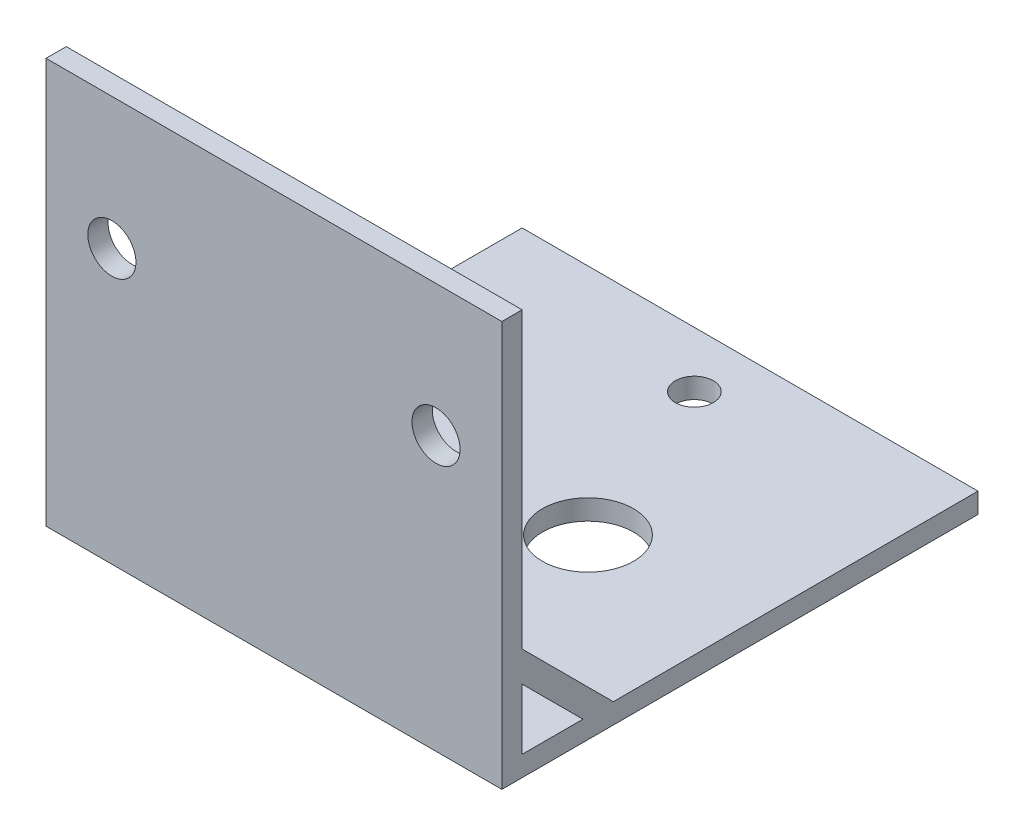
ISO-10303-21;
HEADER;
FILE_DESCRIPTION(('STEP AP214'),'2;1');
FILE_NAME('part.step','',(''),(''),'','','');
FILE_SCHEMA(('AUTOMOTIVE_DESIGN { 1 0 10303 214 1 1 1 1 }'));
ENDSEC;
DATA;
#1=APPLICATION_CONTEXT('core data for automotive mechanical design processes');
#2=APPLICATION_PROTOCOL_DEFINITION('international standard','automotive_design',2000,#1);
#3=PRODUCT_CONTEXT('',#1,'mechanical');
#4=PRODUCT('Part','Part','',(#3));
#5=PRODUCT_RELATED_PRODUCT_CATEGORY('part','',(#4));
#6=PRODUCT_DEFINITION_FORMATION('','',#4);
#7=PRODUCT_DEFINITION_CONTEXT('part definition',#1,'design');
#8=PRODUCT_DEFINITION('design','',#6,#7);
#9=PRODUCT_DEFINITION_SHAPE('','',#8);
#10=(LENGTH_UNIT() NAMED_UNIT(*) SI_UNIT(.MILLI.,.METRE.));
#11=(NAMED_UNIT(*) PLANE_ANGLE_UNIT() SI_UNIT($,.RADIAN.));
#12=(NAMED_UNIT(*) SI_UNIT($,.STERADIAN.) SOLID_ANGLE_UNIT());
#13=UNCERTAINTY_MEASURE_WITH_UNIT(LENGTH_MEASURE(1.E-05),#10,'distance_accuracy_value','');
#14=(GEOMETRIC_REPRESENTATION_CONTEXT(3) GLOBAL_UNCERTAINTY_ASSIGNED_CONTEXT((#13)) GLOBAL_UNIT_ASSIGNED_CONTEXT((#10,
#11,#12)) REPRESENTATION_CONTEXT('',''));
#15=CARTESIAN_POINT('',(0.,0.,0.));
#16=DIRECTION('',(0.,0.,1.));
#17=DIRECTION('',(1.,0.,0.));
#18=AXIS2_PLACEMENT_3D('',#15,#16,#17);
#19=CARTESIAN_POINT('',(0.,2.,0.));
#20=DIRECTION('',(0.,1.,0.));
#21=DIRECTION('',(0.,0.,1.));
#22=AXIS2_PLACEMENT_3D('',#19,#20,#21);
#23=PLANE('',#22);
#24=CARTESIAN_POINT('',(5.75628954535205,2.,136.050969125864));
#25=DIRECTION('',(0.,1.,0.));
#26=DIRECTION('',(0.,0.,1.));
#27=AXIS2_PLACEMENT_3D('',#24,#25,#26);
#28=CIRCLE('',#27,1.875);
#29=CARTESIAN_POINT('',(5.75628954535205,2.,137.925969125864));
#30=VERTEX_POINT('',#29);
#31=EDGE_CURVE('E250',#30,#30,#28,.T.);
#32=ORIENTED_EDGE('',*,*,#31,.F.);
#33=EDGE_LOOP('',(#32));
#34=FACE_BOUND('',#33,.T.);
#35=CARTESIAN_POINT('',(5.75628954535205,2.,101.050969125864));
#36=DIRECTION('',(0.,1.,0.));
#37=DIRECTION('',(0.,0.,1.));
#38=AXIS2_PLACEMENT_3D('',#35,#36,#37);
#39=CIRCLE('',#38,1.875);
#40=CARTESIAN_POINT('',(5.75628954535205,2.,102.925969125864));
#41=VERTEX_POINT('',#40);
#42=EDGE_CURVE('E254',#41,#41,#39,.T.);
#43=ORIENTED_EDGE('',*,*,#42,.F.);
#44=EDGE_LOOP('',(#43));
#45=FACE_BOUND('',#44,.T.);
#46=CARTESIAN_POINT('',(12.756289545352,2.,118.550969125864));
#47=DIRECTION('',(0.,1.,0.));
#48=DIRECTION('',(0.,0.,1.));
#49=AXIS2_PLACEMENT_3D('',#46,#47,#48);
#50=CIRCLE('',#49,4.50000000000002);
#51=CARTESIAN_POINT('',(12.756289545352,2.,123.050969125864));
#52=VERTEX_POINT('',#51);
#53=EDGE_CURVE('E275',#52,#52,#50,.T.);
#54=ORIENTED_EDGE('',*,*,#53,.F.);
#55=EDGE_LOOP('',(#54));
#56=FACE_BOUND('',#55,.T.);
#57=DIRECTION('',(0.,0.,1.));
#58=VECTOR('',#57,1.);
#59=CARTESIAN_POINT('',(26.2562895453521,2.,134.550969125864));
#60=LINE('',#59,#58);
#61=CARTESIAN_POINT('',(26.2562895453521,2.,131.550969125864));
#62=VERTEX_POINT('',#61);
#63=CARTESIAN_POINT('',(26.2562895453521,2.,134.550969125864));
#64=VERTEX_POINT('',#63);
#65=EDGE_CURVE('E143',#62,#64,#60,.T.);
#66=ORIENTED_EDGE('',*,*,#65,.F.);
#67=DIRECTION('',(1.,0.,0.));
#68=VECTOR('',#67,1.);
#69=CARTESIAN_POINT('',(26.2562895453521,2.,131.550969125864));
#70=LINE('',#69,#68);
#71=CARTESIAN_POINT('',(28.2562895453521,2.,131.550969125864));
#72=VERTEX_POINT('',#71);
#73=EDGE_CURVE('E166',#62,#72,#70,.T.);
#74=ORIENTED_EDGE('',*,*,#73,.T.);
#75=DIRECTION('',(0.,0.,1.));
#76=VECTOR('',#75,1.);
#77=CARTESIAN_POINT('',(28.256289545352,2.,0.));
#78=LINE('',#77,#76);
#79=CARTESIAN_POINT('',(28.2562895453521,2.,95.550969125864));
#80=VERTEX_POINT('',#79);
#81=EDGE_CURVE('E271',#80,#72,#78,.T.);
#82=ORIENTED_EDGE('',*,*,#81,.F.);
#83=DIRECTION('',(-1.,0.,0.));
#84=VECTOR('',#83,1.);
#85=CARTESIAN_POINT('',(0.,2.,95.550969125864));
#86=LINE('',#85,#84);
#87=CARTESIAN_POINT('',(-16.7437104546479,2.,95.550969125864));
#88=VERTEX_POINT('',#87);
#89=EDGE_CURVE('E259',#80,#88,#86,.T.);
#90=ORIENTED_EDGE('',*,*,#89,.T.);
#91=DIRECTION('',(0.,0.,1.));
#92=VECTOR('',#91,1.);
#93=CARTESIAN_POINT('',(-16.7437104546479,2.,0.));
#94=LINE('',#93,#92);
#95=CARTESIAN_POINT('',(-16.743710454648,2.,131.550969125864));
#96=VERTEX_POINT('',#95);
#97=EDGE_CURVE('E264',#88,#96,#94,.T.);
#98=ORIENTED_EDGE('',*,*,#97,.T.);
#99=DIRECTION('',(-1.,0.,0.));
#100=VECTOR('',#99,1.);
#101=CARTESIAN_POINT('',(-14.743710454648,2.,131.550969125864));
#102=LINE('',#101,#100);
#103=CARTESIAN_POINT('',(-14.743710454648,2.,131.550969125864));
#104=VERTEX_POINT('',#103);
#105=EDGE_CURVE('E207',#104,#96,#102,.T.);
#106=ORIENTED_EDGE('',*,*,#105,.F.);
#107=DIRECTION('',(0.,0.,1.));
#108=VECTOR('',#107,1.);
#109=CARTESIAN_POINT('',(-14.743710454648,2.,134.550969125864));
#110=LINE('',#109,#108);
#111=CARTESIAN_POINT('',(-14.743710454648,2.,134.550969125864));
#112=VERTEX_POINT('',#111);
#113=EDGE_CURVE('E184',#104,#112,#110,.T.);
#114=ORIENTED_EDGE('',*,*,#113,.T.);
#115=DIRECTION('',(-1.,0.,0.));
#116=VECTOR('',#115,1.);
#117=CARTESIAN_POINT('',(-14.743710454648,2.,134.550969125864));
#118=LINE('',#117,#116);
#119=CARTESIAN_POINT('',(-16.743710454648,2.,134.550969125864));
#120=VERTEX_POINT('',#119);
#121=EDGE_CURVE('E203',#112,#120,#118,.T.);
#122=ORIENTED_EDGE('',*,*,#121,.T.);
#123=CARTESIAN_POINT('',(-16.7437104546479,2.,140.550969125864));
#124=VERTEX_POINT('',#123);
#125=EDGE_CURVE('E263',#120,#124,#94,.T.);
#126=ORIENTED_EDGE('',*,*,#125,.T.);
#127=DIRECTION('',(-1.,0.,0.));
#128=VECTOR('',#127,1.);
#129=CARTESIAN_POINT('',(0.,2.,140.550969125864));
#130=LINE('',#129,#128);
#131=CARTESIAN_POINT('',(28.2562895453521,2.,140.550969125864));
#132=VERTEX_POINT('',#131);
#133=EDGE_CURVE('E267',#132,#124,#130,.T.);
#134=ORIENTED_EDGE('',*,*,#133,.F.);
#135=CARTESIAN_POINT('',(28.2562895453521,2.,134.550969125864));
#136=VERTEX_POINT('',#135);
#137=EDGE_CURVE('E164',#136,#132,#78,.T.);
#138=ORIENTED_EDGE('',*,*,#137,.F.);
#139=DIRECTION('',(1.,0.,0.));
#140=VECTOR('',#139,1.);
#141=CARTESIAN_POINT('',(26.2562895453521,2.,134.550969125864));
#142=LINE('',#141,#140);
#143=EDGE_CURVE('E158',#64,#136,#142,.T.);
#144=ORIENTED_EDGE('',*,*,#143,.F.);
#145=EDGE_LOOP('',(#66,#74,#82,#90,#98,#106,#114,#122,#126,#134,#138,#144));
#146=FACE_BOUND('',#145,.T.);
#147=ADVANCED_FACE('F41',(#34,#45,#56,#146),#23,.T.);
#148=CARTESIAN_POINT('',(0.,40.,140.550969125864));
#149=DIRECTION('',(0.,0.,1.));
#150=DIRECTION('',(1.,0.,0.));
#151=AXIS2_PLACEMENT_3D('',#148,#149,#150);
#152=PLANE('',#151);
#153=CARTESIAN_POINT('',(21.756289545352,27.,140.550969125864));
#154=DIRECTION('',(0.,0.,1.));
#155=DIRECTION('',(1.,0.,0.));
#156=AXIS2_PLACEMENT_3D('',#153,#154,#155);
#157=CIRCLE('',#156,2.375);
#158=CARTESIAN_POINT('',(24.131289545352,27.,140.550969125864));
#159=VERTEX_POINT('',#158);
#160=EDGE_CURVE('E331',#159,#159,#157,.T.);
#161=ORIENTED_EDGE('',*,*,#160,.T.);
#162=EDGE_LOOP('',(#161));
#163=FACE_BOUND('',#162,.T.);
#164=CARTESIAN_POINT('',(-10.243710454648,27.,140.550969125864));
#165=DIRECTION('',(0.,0.,1.));
#166=DIRECTION('',(1.,0.,0.));
#167=AXIS2_PLACEMENT_3D('',#164,#165,#166);
#168=CIRCLE('',#167,2.375);
#169=CARTESIAN_POINT('',(-7.86871045464796,27.,140.550969125864));
#170=VERTEX_POINT('',#169);
#171=EDGE_CURVE('E339',#170,#170,#168,.T.);
#172=ORIENTED_EDGE('',*,*,#171,.T.);
#173=EDGE_LOOP('',(#172));
#174=FACE_BOUND('',#173,.T.);
#175=DIRECTION('',(1.,0.,0.));
#176=VECTOR('',#175,1.);
#177=CARTESIAN_POINT('',(26.2562895453521,11.,140.550969125864));
#178=LINE('',#177,#176);
#179=CARTESIAN_POINT('',(26.2562895453521,11.,140.550969125864));
#180=VERTEX_POINT('',#179);
#181=CARTESIAN_POINT('',(28.2562895453521,11.,140.550969125864));
#182=VERTEX_POINT('',#181);
#183=EDGE_CURVE('E170',#180,#182,#178,.T.);
#184=ORIENTED_EDGE('',*,*,#183,.F.);
#185=DIRECTION('',(0.,1.,0.));
#186=VECTOR('',#185,1.);
#187=CARTESIAN_POINT('',(26.2562895453521,11.,140.550969125864));
#188=LINE('',#187,#186);
#189=CARTESIAN_POINT('',(26.2562895453521,8.,140.550969125864));
#190=VERTEX_POINT('',#189);
#191=EDGE_CURVE('E65',#190,#180,#188,.T.);
#192=ORIENTED_EDGE('',*,*,#191,.F.);
#193=DIRECTION('',(1.,0.,0.));
#194=VECTOR('',#193,1.);
#195=CARTESIAN_POINT('',(26.2562895453521,8.,140.550969125864));
#196=LINE('',#195,#194);
#197=CARTESIAN_POINT('',(28.2562895453521,8.,140.550969125864));
#198=VERTEX_POINT('',#197);
#199=EDGE_CURVE('E160',#190,#198,#196,.T.);
#200=ORIENTED_EDGE('',*,*,#199,.T.);
#201=DIRECTION('',(0.,-1.,0.));
#202=VECTOR('',#201,1.);
#203=CARTESIAN_POINT('',(28.2562895453521,40.,140.550969125864));
#204=LINE('',#203,#202);
#205=EDGE_CURVE('E229',#198,#132,#204,.T.);
#206=ORIENTED_EDGE('',*,*,#205,.T.);
#207=ORIENTED_EDGE('',*,*,#133,.T.);
#208=DIRECTION('',(0.,-1.,0.));
#209=VECTOR('',#208,1.);
#210=CARTESIAN_POINT('',(-16.7437104546479,40.,140.550969125864));
#211=LINE('',#210,#209);
#212=CARTESIAN_POINT('',(-16.7437104546479,8.,140.550969125864));
#213=VERTEX_POINT('',#212);
#214=EDGE_CURVE('E244',#213,#124,#211,.T.);
#215=ORIENTED_EDGE('',*,*,#214,.F.);
#216=DIRECTION('',(-1.,0.,0.));
#217=VECTOR('',#216,1.);
#218=CARTESIAN_POINT('',(-14.743710454648,8.,140.550969125864));
#219=LINE('',#218,#217);
#220=CARTESIAN_POINT('',(-14.743710454648,8.,140.550969125864));
#221=VERTEX_POINT('',#220);
#222=EDGE_CURVE('E198',#221,#213,#219,.T.);
#223=ORIENTED_EDGE('',*,*,#222,.F.);
#224=DIRECTION('',(0.,1.,0.));
#225=VECTOR('',#224,1.);
#226=CARTESIAN_POINT('',(-14.743710454648,11.,140.550969125864));
#227=LINE('',#226,#225);
#228=CARTESIAN_POINT('',(-14.743710454648,11.,140.550969125864));
#229=VERTEX_POINT('',#228);
#230=EDGE_CURVE('E175',#221,#229,#227,.T.);
#231=ORIENTED_EDGE('',*,*,#230,.T.);
#232=DIRECTION('',(-1.,0.,0.));
#233=VECTOR('',#232,1.);
#234=CARTESIAN_POINT('',(-14.743710454648,11.,140.550969125864));
#235=LINE('',#234,#233);
#236=CARTESIAN_POINT('',(-16.743710454648,11.,140.550969125864));
#237=VERTEX_POINT('',#236);
#238=EDGE_CURVE('E191',#229,#237,#235,.T.);
#239=ORIENTED_EDGE('',*,*,#238,.T.);
#240=CARTESIAN_POINT('',(-16.7437104546479,40.,140.550969125864));
#241=VERTEX_POINT('',#240);
#242=EDGE_CURVE('E245',#241,#237,#211,.T.);
#243=ORIENTED_EDGE('',*,*,#242,.F.);
#244=DIRECTION('',(-1.,0.,0.));
#245=VECTOR('',#244,1.);
#246=CARTESIAN_POINT('',(0.,40.,140.550969125864));
#247=LINE('',#246,#245);
#248=CARTESIAN_POINT('',(28.2562895453521,40.,140.550969125864));
#249=VERTEX_POINT('',#248);
#250=EDGE_CURVE('E214',#249,#241,#247,.T.);
#251=ORIENTED_EDGE('',*,*,#250,.F.);
#252=EDGE_CURVE('E233',#249,#182,#204,.T.);
#253=ORIENTED_EDGE('',*,*,#252,.T.);
#254=EDGE_LOOP('',(#184,#192,#200,#206,#207,#215,#223,#231,#239,#243,#251,#253));
#255=FACE_BOUND('',#254,.T.);
#256=ADVANCED_FACE('F367',(#163,#174,#255),#152,.F.);
#257=CARTESIAN_POINT('',(0.,2.,95.550969125864));
#258=DIRECTION('',(0.,0.,1.));
#259=DIRECTION('',(1.,0.,0.));
#260=AXIS2_PLACEMENT_3D('',#257,#258,#259);
#261=PLANE('',#260);
#262=DIRECTION('',(-1.,0.,0.));
#263=VECTOR('',#262,1.);
#264=CARTESIAN_POINT('',(0.,0.,95.550969125864));
#265=LINE('',#264,#263);
#266=CARTESIAN_POINT('',(28.2562895453521,0.,95.550969125864));
#267=VERTEX_POINT('',#266);
#268=CARTESIAN_POINT('',(-16.7437104546479,0.,95.550969125864));
#269=VERTEX_POINT('',#268);
#270=EDGE_CURVE('E286',#267,#269,#265,.T.);
#271=ORIENTED_EDGE('',*,*,#270,.T.);
#272=DIRECTION('',(0.,-1.,0.));
#273=VECTOR('',#272,1.);
#274=CARTESIAN_POINT('',(-16.7437104546479,2.,95.550969125864));
#275=LINE('',#274,#273);
#276=EDGE_CURVE('E11',#88,#269,#275,.T.);
#277=ORIENTED_EDGE('',*,*,#276,.F.);
#278=ORIENTED_EDGE('',*,*,#89,.F.);
#279=DIRECTION('',(0.,-1.,0.));
#280=VECTOR('',#279,1.);
#281=CARTESIAN_POINT('',(28.2562895453521,2.,95.550969125864));
#282=LINE('',#281,#280);
#283=EDGE_CURVE('E50',#80,#267,#282,.T.);
#284=ORIENTED_EDGE('',*,*,#283,.T.);
#285=EDGE_LOOP('',(#271,#277,#278,#284));
#286=FACE_BOUND('',#285,.T.);
#287=ADVANCED_FACE('F302',(#286),#261,.F.);
#288=CARTESIAN_POINT('',(-16.7437104546479,2.,0.));
#289=DIRECTION('',(1.,0.,0.));
#290=DIRECTION('',(0.,0.,-1.));
#291=AXIS2_PLACEMENT_3D('',#288,#289,#290);
#292=PLANE('',#291);
#293=ORIENTED_EDGE('',*,*,#125,.F.);
#294=DIRECTION('',(0.,0.707106781186547,0.707106781186548));
#295=VECTOR('',#294,1.);
#296=CARTESIAN_POINT('',(-16.743710454648,8.,140.550969125864));
#297=LINE('',#296,#295);
#298=EDGE_CURVE('E180',#120,#213,#297,.T.);
#299=ORIENTED_EDGE('',*,*,#298,.T.);
#300=ORIENTED_EDGE('',*,*,#214,.T.);
#301=EDGE_LOOP('',(#293,#299,#300));
#302=FACE_BOUND('',#301,.T.);
#303=DIRECTION('',(0.,0.,1.));
#304=VECTOR('',#303,1.);
#305=CARTESIAN_POINT('',(-16.7437104546479,0.,0.));
#306=LINE('',#305,#304);
#307=CARTESIAN_POINT('',(-16.743710454648,0.,142.550969125864));
#308=VERTEX_POINT('',#307);
#309=EDGE_CURVE('E290',#269,#308,#306,.T.);
#310=ORIENTED_EDGE('',*,*,#309,.T.);
#311=DIRECTION('',(0.,-1.,0.));
#312=VECTOR('',#311,1.);
#313=CARTESIAN_POINT('',(-16.743710454648,40.,142.550969125864));
#314=LINE('',#313,#312);
#315=CARTESIAN_POINT('',(-16.743710454648,40.,142.550969125864));
#316=VERTEX_POINT('',#315);
#317=EDGE_CURVE('E240',#316,#308,#314,.T.);
#318=ORIENTED_EDGE('',*,*,#317,.F.);
#319=DIRECTION('',(0.,0.,1.));
#320=VECTOR('',#319,1.);
#321=CARTESIAN_POINT('',(-16.7437104546479,40.,0.));
#322=LINE('',#321,#320);
#323=EDGE_CURVE('E218',#241,#316,#322,.T.);
#324=ORIENTED_EDGE('',*,*,#323,.F.);
#325=ORIENTED_EDGE('',*,*,#242,.T.);
#326=DIRECTION('',(0.,-0.707106781186547,-0.707106781186548));
#327=VECTOR('',#326,1.);
#328=CARTESIAN_POINT('',(-16.743710454648,2.,131.550969125864));
#329=LINE('',#328,#327);
#330=EDGE_CURVE('E192',#237,#96,#329,.T.);
#331=ORIENTED_EDGE('',*,*,#330,.T.);
#332=ORIENTED_EDGE('',*,*,#97,.F.);
#333=ORIENTED_EDGE('',*,*,#276,.T.);
#334=EDGE_LOOP('',(#310,#318,#324,#325,#331,#332,#333));
#335=FACE_BOUND('',#334,.T.);
#336=ADVANCED_FACE('F318',(#302,#335),#292,.F.);
#337=CARTESIAN_POINT('',(28.256289545352,2.,0.));
#338=DIRECTION('',(1.,0.,0.));
#339=DIRECTION('',(0.,0.,-1.));
#340=AXIS2_PLACEMENT_3D('',#337,#338,#339);
#341=PLANE('',#340);
#342=DIRECTION('',(0.,0.707106781186547,0.707106781186548));
#343=VECTOR('',#342,1.);
#344=CARTESIAN_POINT('',(28.2562895453521,8.,140.550969125864));
#345=LINE('',#344,#343);
#346=EDGE_CURVE('E57',#136,#198,#345,.T.);
#347=ORIENTED_EDGE('',*,*,#346,.F.);
#348=ORIENTED_EDGE('',*,*,#137,.T.);
#349=ORIENTED_EDGE('',*,*,#205,.F.);
#350=EDGE_LOOP('',(#347,#348,#349));
#351=FACE_BOUND('',#350,.T.);
#352=DIRECTION('',(0.,0.,1.));
#353=VECTOR('',#352,1.);
#354=CARTESIAN_POINT('',(28.256289545352,0.,0.));
#355=LINE('',#354,#353);
#356=CARTESIAN_POINT('',(28.2562895453521,0.,142.550969125864));
#357=VERTEX_POINT('',#356);
#358=EDGE_CURVE('E293',#267,#357,#355,.T.);
#359=ORIENTED_EDGE('',*,*,#358,.F.);
#360=ORIENTED_EDGE('',*,*,#283,.F.);
#361=ORIENTED_EDGE('',*,*,#81,.T.);
#362=DIRECTION('',(0.,-0.707106781186547,-0.707106781186548));
#363=VECTOR('',#362,1.);
#364=CARTESIAN_POINT('',(28.2562895453521,2.,131.550969125864));
#365=LINE('',#364,#363);
#366=EDGE_CURVE('E320',#182,#72,#365,.T.);
#367=ORIENTED_EDGE('',*,*,#366,.F.);
#368=ORIENTED_EDGE('',*,*,#252,.F.);
#369=DIRECTION('',(0.,0.,1.));
#370=VECTOR('',#369,1.);
#371=CARTESIAN_POINT('',(28.256289545352,40.,0.));
#372=LINE('',#371,#370);
#373=CARTESIAN_POINT('',(28.2562895453521,40.,142.550969125864));
#374=VERTEX_POINT('',#373);
#375=EDGE_CURVE('E225',#249,#374,#372,.T.);
#376=ORIENTED_EDGE('',*,*,#375,.T.);
#377=DIRECTION('',(0.,-1.,0.));
#378=VECTOR('',#377,1.);
#379=CARTESIAN_POINT('',(28.2562895453521,40.,142.550969125864));
#380=LINE('',#379,#378);
#381=EDGE_CURVE('E236',#374,#357,#380,.T.);
#382=ORIENTED_EDGE('',*,*,#381,.T.);
#383=EDGE_LOOP('',(#359,#360,#361,#367,#368,#376,#382));
#384=FACE_BOUND('',#383,.T.);
#385=ADVANCED_FACE('F310',(#351,#384),#341,.T.);
#386=CARTESIAN_POINT('',(5.75628954535205,2.,101.050969125864));
#387=DIRECTION('',(0.,-1.,0.));
#388=DIRECTION('',(0.,0.,-1.));
#389=AXIS2_PLACEMENT_3D('',#386,#387,#388);
#390=CYLINDRICAL_SURFACE('',#389,1.875);
#391=ORIENTED_EDGE('',*,*,#42,.T.);
#392=EDGE_LOOP('',(#391));
#393=FACE_BOUND('',#392,.T.);
#394=CARTESIAN_POINT('',(5.75628954535205,0.,101.050969125864));
#395=DIRECTION('',(0.,1.,0.));
#396=DIRECTION('',(0.,0.,1.));
#397=AXIS2_PLACEMENT_3D('',#394,#395,#396);
#398=CIRCLE('',#397,1.875);
#399=CARTESIAN_POINT('',(5.75628954535205,0.,102.925969125864));
#400=VERTEX_POINT('',#399);
#401=EDGE_CURVE('E282',#400,#400,#398,.T.);
#402=ORIENTED_EDGE('',*,*,#401,.F.);
#403=EDGE_LOOP('',(#402));
#404=FACE_BOUND('',#403,.T.);
#405=ADVANCED_FACE('F389',(#393,#404),#390,.F.);
#406=CARTESIAN_POINT('',(5.75628954535205,2.,136.050969125864));
#407=DIRECTION('',(0.,-1.,0.));
#408=DIRECTION('',(0.,0.,-1.));
#409=AXIS2_PLACEMENT_3D('',#406,#407,#408);
#410=CYLINDRICAL_SURFACE('',#409,1.875);
#411=ORIENTED_EDGE('',*,*,#31,.T.);
#412=EDGE_LOOP('',(#411));
#413=FACE_BOUND('',#412,.T.);
#414=CARTESIAN_POINT('',(5.75628954535205,0.,136.050969125864));
#415=DIRECTION('',(0.,1.,0.));
#416=DIRECTION('',(0.,0.,1.));
#417=AXIS2_PLACEMENT_3D('',#414,#415,#416);
#418=CIRCLE('',#417,1.875);
#419=CARTESIAN_POINT('',(5.75628954535205,0.,137.925969125864));
#420=VERTEX_POINT('',#419);
#421=EDGE_CURVE('E249',#420,#420,#418,.T.);
#422=ORIENTED_EDGE('',*,*,#421,.F.);
#423=EDGE_LOOP('',(#422));
#424=FACE_BOUND('',#423,.T.);
#425=ADVANCED_FACE('F43',(#413,#424),#410,.F.);
#426=CARTESIAN_POINT('',(12.756289545352,2.,118.550969125864));
#427=DIRECTION('',(0.,-1.,0.));
#428=DIRECTION('',(0.,0.,-1.));
#429=AXIS2_PLACEMENT_3D('',#426,#427,#428);
#430=CYLINDRICAL_SURFACE('',#429,4.50000000000002);
#431=ORIENTED_EDGE('',*,*,#53,.T.);
#432=EDGE_LOOP('',(#431));
#433=FACE_BOUND('',#432,.T.);
#434=CARTESIAN_POINT('',(12.756289545352,0.,118.550969125864));
#435=DIRECTION('',(0.,1.,0.));
#436=DIRECTION('',(0.,0.,1.));
#437=AXIS2_PLACEMENT_3D('',#434,#435,#436);
#438=CIRCLE('',#437,4.50000000000002);
#439=CARTESIAN_POINT('',(12.756289545352,0.,123.050969125864));
#440=VERTEX_POINT('',#439);
#441=EDGE_CURVE('E255',#440,#440,#438,.T.);
#442=ORIENTED_EDGE('',*,*,#441,.F.);
#443=EDGE_LOOP('',(#442));
#444=FACE_BOUND('',#443,.T.);
#445=ADVANCED_FACE('F382',(#433,#444),#430,.F.);
#446=CARTESIAN_POINT('',(0.,0.,0.));
#447=DIRECTION('',(0.,1.,0.));
#448=DIRECTION('',(0.,0.,1.));
#449=AXIS2_PLACEMENT_3D('',#446,#447,#448);
#450=PLANE('',#449);
#451=ORIENTED_EDGE('',*,*,#421,.T.);
#452=EDGE_LOOP('',(#451));
#453=FACE_BOUND('',#452,.T.);
#454=ORIENTED_EDGE('',*,*,#401,.T.);
#455=EDGE_LOOP('',(#454));
#456=FACE_BOUND('',#455,.T.);
#457=ORIENTED_EDGE('',*,*,#270,.F.);
#458=ORIENTED_EDGE('',*,*,#358,.T.);
#459=DIRECTION('',(-1.,0.,0.));
#460=VECTOR('',#459,1.);
#461=CARTESIAN_POINT('',(0.,0.,142.550969125864));
#462=LINE('',#461,#460);
#463=EDGE_CURVE('E202',#357,#308,#462,.T.);
#464=ORIENTED_EDGE('',*,*,#463,.T.);
#465=ORIENTED_EDGE('',*,*,#309,.F.);
#466=EDGE_LOOP('',(#457,#458,#464,#465));
#467=FACE_BOUND('',#466,.T.);
#468=ORIENTED_EDGE('',*,*,#441,.T.);
#469=EDGE_LOOP('',(#468));
#470=FACE_BOUND('',#469,.T.);
#471=ADVANCED_FACE('F308',(#453,#456,#467,#470),#450,.F.);
#472=CARTESIAN_POINT('',(0.,40.,142.550969125864));
#473=DIRECTION('',(0.,0.,1.));
#474=DIRECTION('',(1.,0.,0.));
#475=AXIS2_PLACEMENT_3D('',#472,#473,#474);
#476=PLANE('',#475);
#477=CARTESIAN_POINT('',(21.756289545352,27.,142.550969125864));
#478=DIRECTION('',(0.,0.,1.));
#479=DIRECTION('',(1.,0.,0.));
#480=AXIS2_PLACEMENT_3D('',#477,#478,#479);
#481=CIRCLE('',#480,2.375);
#482=CARTESIAN_POINT('',(24.131289545352,27.,142.550969125864));
#483=VERTEX_POINT('',#482);
#484=EDGE_CURVE('E343',#483,#483,#481,.T.);
#485=ORIENTED_EDGE('',*,*,#484,.F.);
#486=EDGE_LOOP('',(#485));
#487=FACE_BOUND('',#486,.T.);
#488=CARTESIAN_POINT('',(-10.243710454648,27.,142.550969125864));
#489=DIRECTION('',(0.,0.,1.));
#490=DIRECTION('',(1.,0.,0.));
#491=AXIS2_PLACEMENT_3D('',#488,#489,#490);
#492=CIRCLE('',#491,2.375);
#493=CARTESIAN_POINT('',(-7.86871045464796,27.,142.550969125864));
#494=VERTEX_POINT('',#493);
#495=EDGE_CURVE('E344',#494,#494,#492,.T.);
#496=ORIENTED_EDGE('',*,*,#495,.F.);
#497=EDGE_LOOP('',(#496));
#498=FACE_BOUND('',#497,.T.);
#499=ORIENTED_EDGE('',*,*,#463,.F.);
#500=ORIENTED_EDGE('',*,*,#381,.F.);
#501=DIRECTION('',(-1.,0.,0.));
#502=VECTOR('',#501,1.);
#503=CARTESIAN_POINT('',(0.,40.,142.550969125864));
#504=LINE('',#503,#502);
#505=EDGE_CURVE('E221',#374,#316,#504,.T.);
#506=ORIENTED_EDGE('',*,*,#505,.T.);
#507=ORIENTED_EDGE('',*,*,#317,.T.);
#508=EDGE_LOOP('',(#499,#500,#506,#507));
#509=FACE_BOUND('',#508,.T.);
#510=ADVANCED_FACE('F315',(#487,#498,#509),#476,.T.);
#511=CARTESIAN_POINT('',(0.,40.,0.));
#512=DIRECTION('',(0.,1.,0.));
#513=DIRECTION('',(0.,0.,1.));
#514=AXIS2_PLACEMENT_3D('',#511,#512,#513);
#515=PLANE('',#514);
#516=ORIENTED_EDGE('',*,*,#250,.T.);
#517=ORIENTED_EDGE('',*,*,#323,.T.);
#518=ORIENTED_EDGE('',*,*,#505,.F.);
#519=ORIENTED_EDGE('',*,*,#375,.F.);
#520=EDGE_LOOP('',(#516,#517,#518,#519));
#521=FACE_BOUND('',#520,.T.);
#522=ADVANCED_FACE('F357',(#521),#515,.T.);
#523=CARTESIAN_POINT('',(-14.743710454648,8.,140.550969125864));
#524=DIRECTION('',(0.,-0.707106781186548,0.707106781186547));
#525=DIRECTION('',(0.,-0.707106781186547,-0.707106781186548));
#526=AXIS2_PLACEMENT_3D('',#523,#524,#525);
#527=PLANE('',#526);
#528=ORIENTED_EDGE('',*,*,#298,.F.);
#529=ORIENTED_EDGE('',*,*,#121,.F.);
#530=DIRECTION('',(0.,0.707106781186547,0.707106781186548));
#531=VECTOR('',#530,1.);
#532=CARTESIAN_POINT('',(-14.743710454648,8.,140.550969125864));
#533=LINE('',#532,#531);
#534=EDGE_CURVE('E187',#112,#221,#533,.T.);
#535=ORIENTED_EDGE('',*,*,#534,.T.);
#536=ORIENTED_EDGE('',*,*,#222,.T.);
#537=EDGE_LOOP('',(#528,#529,#535,#536));
#538=FACE_BOUND('',#537,.T.);
#539=ADVANCED_FACE('F431',(#538),#527,.T.);
#540=CARTESIAN_POINT('',(-14.743710454648,2.,131.550969125864));
#541=DIRECTION('',(0.,0.707106781186548,-0.707106781186547));
#542=DIRECTION('',(0.,0.707106781186547,0.707106781186548));
#543=AXIS2_PLACEMENT_3D('',#540,#541,#542);
#544=PLANE('',#543);
#545=ORIENTED_EDGE('',*,*,#330,.F.);
#546=ORIENTED_EDGE('',*,*,#238,.F.);
#547=DIRECTION('',(0.,-0.707106781186547,-0.707106781186548));
#548=VECTOR('',#547,1.);
#549=CARTESIAN_POINT('',(-14.743710454648,2.,131.550969125864));
#550=LINE('',#549,#548);
#551=EDGE_CURVE('E179',#229,#104,#550,.T.);
#552=ORIENTED_EDGE('',*,*,#551,.T.);
#553=ORIENTED_EDGE('',*,*,#105,.T.);
#554=EDGE_LOOP('',(#545,#546,#552,#553));
#555=FACE_BOUND('',#554,.T.);
#556=ADVANCED_FACE('F439',(#555),#544,.T.);
#557=CARTESIAN_POINT('',(-14.743710454648,0.,0.));
#558=DIRECTION('',(1.,0.,0.));
#559=DIRECTION('',(0.,0.,-1.));
#560=AXIS2_PLACEMENT_3D('',#557,#558,#559);
#561=PLANE('',#560);
#562=ORIENTED_EDGE('',*,*,#230,.F.);
#563=ORIENTED_EDGE('',*,*,#534,.F.);
#564=ORIENTED_EDGE('',*,*,#113,.F.);
#565=ORIENTED_EDGE('',*,*,#551,.F.);
#566=EDGE_LOOP('',(#562,#563,#564,#565));
#567=FACE_BOUND('',#566,.T.);
#568=ADVANCED_FACE('F447',(#567),#561,.T.);
#569=CARTESIAN_POINT('',(26.2562895453521,2.,131.550969125864));
#570=DIRECTION('',(0.,-0.707106781186548,0.707106781186547));
#571=DIRECTION('',(0.,-0.707106781186547,-0.707106781186548));
#572=AXIS2_PLACEMENT_3D('',#569,#570,#571);
#573=PLANE('',#572);
#574=ORIENTED_EDGE('',*,*,#366,.T.);
#575=ORIENTED_EDGE('',*,*,#73,.F.);
#576=DIRECTION('',(0.,-0.707106781186547,-0.707106781186548));
#577=VECTOR('',#576,1.);
#578=CARTESIAN_POINT('',(26.2562895453521,2.,131.550969125864));
#579=LINE('',#578,#577);
#580=EDGE_CURVE('E149',#180,#62,#579,.T.);
#581=ORIENTED_EDGE('',*,*,#580,.F.);
#582=ORIENTED_EDGE('',*,*,#183,.T.);
#583=EDGE_LOOP('',(#574,#575,#581,#582));
#584=FACE_BOUND('',#583,.T.);
#585=ADVANCED_FACE('F326',(#584),#573,.F.);
#586=CARTESIAN_POINT('',(26.2562895453521,8.,140.550969125864));
#587=DIRECTION('',(0.,0.707106781186548,-0.707106781186547));
#588=DIRECTION('',(0.,0.707106781186547,0.707106781186548));
#589=AXIS2_PLACEMENT_3D('',#586,#587,#588);
#590=PLANE('',#589);
#591=ORIENTED_EDGE('',*,*,#346,.T.);
#592=ORIENTED_EDGE('',*,*,#199,.F.);
#593=DIRECTION('',(0.,0.707106781186547,0.707106781186548));
#594=VECTOR('',#593,1.);
#595=CARTESIAN_POINT('',(26.2562895453521,8.,140.550969125864));
#596=LINE('',#595,#594);
#597=EDGE_CURVE('E146',#64,#190,#596,.T.);
#598=ORIENTED_EDGE('',*,*,#597,.F.);
#599=ORIENTED_EDGE('',*,*,#143,.T.);
#600=EDGE_LOOP('',(#591,#592,#598,#599));
#601=FACE_BOUND('',#600,.T.);
#602=ADVANCED_FACE('F157',(#601),#590,.F.);
#603=CARTESIAN_POINT('',(26.256289545352,0.,0.));
#604=DIRECTION('',(-1.,0.,0.));
#605=DIRECTION('',(0.,0.,-1.));
#606=AXIS2_PLACEMENT_3D('',#603,#604,#605);
#607=PLANE('',#606);
#608=ORIENTED_EDGE('',*,*,#191,.T.);
#609=ORIENTED_EDGE('',*,*,#580,.T.);
#610=ORIENTED_EDGE('',*,*,#65,.T.);
#611=ORIENTED_EDGE('',*,*,#597,.T.);
#612=EDGE_LOOP('',(#608,#609,#610,#611));
#613=FACE_BOUND('',#612,.T.);
#614=ADVANCED_FACE('F145',(#613),#607,.T.);
#615=CARTESIAN_POINT('',(-10.243710454648,27.,137.550969125864));
#616=DIRECTION('',(0.,0.,1.));
#617=DIRECTION('',(1.,0.,0.));
#618=AXIS2_PLACEMENT_3D('',#615,#616,#617);
#619=CYLINDRICAL_SURFACE('',#618,2.375);
#620=ORIENTED_EDGE('',*,*,#495,.T.);
#621=EDGE_LOOP('',(#620));
#622=FACE_BOUND('',#621,.T.);
#623=ORIENTED_EDGE('',*,*,#171,.F.);
#624=EDGE_LOOP('',(#623));
#625=FACE_BOUND('',#624,.T.);
#626=ADVANCED_FACE('F361',(#622,#625),#619,.F.);
#627=CARTESIAN_POINT('',(21.756289545352,27.,137.550969125864));
#628=DIRECTION('',(0.,0.,1.));
#629=DIRECTION('',(1.,0.,0.));
#630=AXIS2_PLACEMENT_3D('',#627,#628,#629);
#631=CYLINDRICAL_SURFACE('',#630,2.375);
#632=ORIENTED_EDGE('',*,*,#484,.T.);
#633=EDGE_LOOP('',(#632));
#634=FACE_BOUND('',#633,.T.);
#635=ORIENTED_EDGE('',*,*,#160,.F.);
#636=EDGE_LOOP('',(#635));
#637=FACE_BOUND('',#636,.T.);
#638=ADVANCED_FACE('F352',(#634,#637),#631,.F.);
#639=CLOSED_SHELL('',(#147,#256,#287,#336,#385,#405,#425,#445,#471,#510,#522,#539,#556,#568,
#585,#602,#614,#626,#638));
#640=MANIFOLD_SOLID_BREP('B2',#639);
#641=ADVANCED_BREP_SHAPE_REPRESENTATION('',(#18,#640),#14);
#642=SHAPE_DEFINITION_REPRESENTATION(#9,#641);
ENDSEC;
END-ISO-10303-21;
